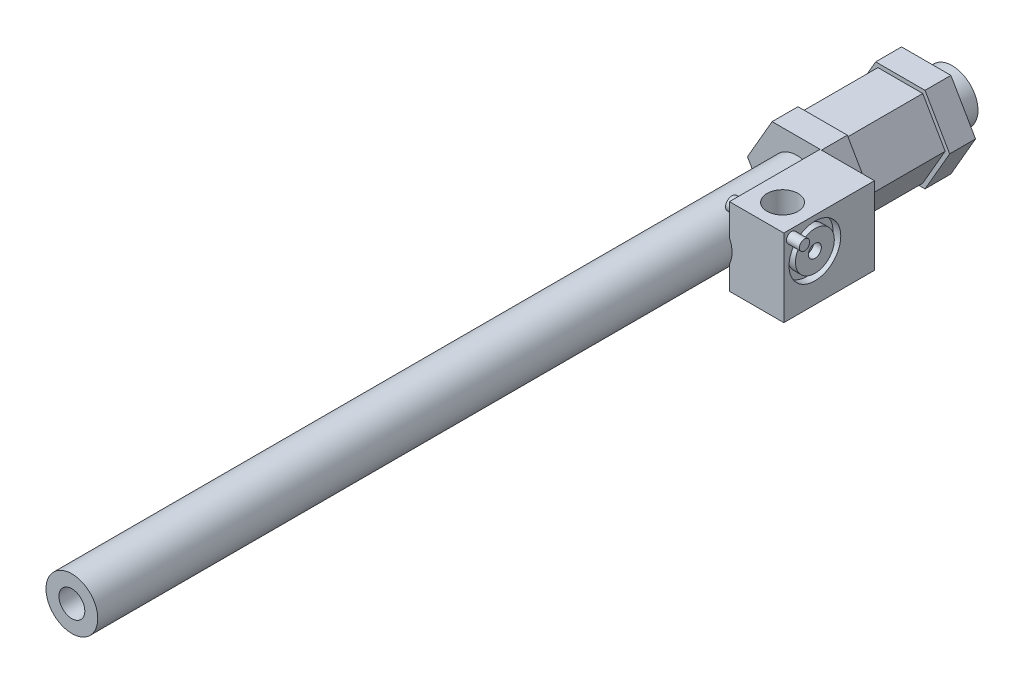
ISO-10303-21;
HEADER;
FILE_DESCRIPTION(('STEP AP214'),'2;1');
FILE_NAME('part.step','',(''),(''),'','','');
FILE_SCHEMA(('AUTOMOTIVE_DESIGN { 1 0 10303 214 1 1 1 1 }'));
ENDSEC;
DATA;
#1=APPLICATION_CONTEXT('core data for automotive mechanical design processes');
#2=APPLICATION_PROTOCOL_DEFINITION('international standard','automotive_design',2000,#1);
#3=PRODUCT_CONTEXT('',#1,'mechanical');
#4=PRODUCT('Part','Part','',(#3));
#5=PRODUCT_RELATED_PRODUCT_CATEGORY('part','',(#4));
#6=PRODUCT_DEFINITION_FORMATION('','',#4);
#7=PRODUCT_DEFINITION_CONTEXT('part definition',#1,'design');
#8=PRODUCT_DEFINITION('design','',#6,#7);
#9=PRODUCT_DEFINITION_SHAPE('','',#8);
#10=(LENGTH_UNIT() NAMED_UNIT(*) SI_UNIT(.MILLI.,.METRE.));
#11=(NAMED_UNIT(*) PLANE_ANGLE_UNIT() SI_UNIT($,.RADIAN.));
#12=(NAMED_UNIT(*) SI_UNIT($,.STERADIAN.) SOLID_ANGLE_UNIT());
#13=UNCERTAINTY_MEASURE_WITH_UNIT(LENGTH_MEASURE(1.E-05),#10,'distance_accuracy_value','');
#14=(GEOMETRIC_REPRESENTATION_CONTEXT(3) GLOBAL_UNCERTAINTY_ASSIGNED_CONTEXT((#13)) GLOBAL_UNIT_ASSIGNED_CONTEXT((#10,
#11,#12)) REPRESENTATION_CONTEXT('',''));
#15=CARTESIAN_POINT('',(0.,0.,0.));
#16=DIRECTION('',(0.,0.,1.));
#17=DIRECTION('',(1.,0.,0.));
#18=AXIS2_PLACEMENT_3D('',#15,#16,#17);
#19=CARTESIAN_POINT('',(0.,0.,60.));
#20=DIRECTION('',(0.,0.,-1.));
#21=DIRECTION('',(-1.,0.,0.));
#22=AXIS2_PLACEMENT_3D('',#19,#20,#21);
#23=PLANE('',#22);
#24=DIRECTION('',(1.,0.,0.));
#25=VECTOR('',#24,1.);
#26=CARTESIAN_POINT('',(9.,-13.5,60.));
#27=LINE('',#26,#25);
#28=CARTESIAN_POINT('',(9.,-13.5,60.));
#29=VERTEX_POINT('',#28);
#30=CARTESIAN_POINT('',(11.2583302491977,-13.5,60.));
#31=VERTEX_POINT('',#30);
#32=EDGE_CURVE('E215',#29,#31,#27,.T.);
#33=ORIENTED_EDGE('',*,*,#32,.F.);
#34=DIRECTION('',(0.,1.,0.));
#35=VECTOR('',#34,1.);
#36=CARTESIAN_POINT('',(9.,0.,60.));
#37=LINE('',#36,#35);
#38=CARTESIAN_POINT('',(9.,-4.35889894354067,60.));
#39=VERTEX_POINT('',#38);
#40=EDGE_CURVE('E416',#29,#39,#37,.T.);
#41=ORIENTED_EDGE('',*,*,#40,.T.);
#42=CARTESIAN_POINT('',(0.,0.,60.));
#43=DIRECTION('',(0.,0.,-1.));
#44=DIRECTION('',(-1.,0.,0.));
#45=AXIS2_PLACEMENT_3D('',#42,#43,#44);
#46=CIRCLE('',#45,10.);
#47=CARTESIAN_POINT('',(9.,4.35889894354067,60.));
#48=VERTEX_POINT('',#47);
#49=EDGE_CURVE('E411',#39,#48,#46,.T.);
#50=ORIENTED_EDGE('',*,*,#49,.T.);
#51=DIRECTION('',(0.,-1.,0.));
#52=VECTOR('',#51,1.);
#53=CARTESIAN_POINT('',(9.,16.5,60.));
#54=LINE('',#53,#52);
#55=CARTESIAN_POINT('',(9.,16.5,60.));
#56=VERTEX_POINT('',#55);
#57=EDGE_CURVE('E242',#56,#48,#54,.T.);
#58=ORIENTED_EDGE('',*,*,#57,.F.);
#59=DIRECTION('',(1.,0.,0.));
#60=VECTOR('',#59,1.);
#61=CARTESIAN_POINT('',(-9.52627944162882,16.5,60.));
#62=LINE('',#61,#60);
#63=CARTESIAN_POINT('',(-9.52627944162882,16.5,60.));
#64=VERTEX_POINT('',#63);
#65=EDGE_CURVE('E287',#64,#56,#62,.T.);
#66=ORIENTED_EDGE('',*,*,#65,.F.);
#67=DIRECTION('',(0.5,0.866025403784438,0.));
#68=VECTOR('',#67,1.);
#69=CARTESIAN_POINT('',(-19.0525588832576,0.,60.));
#70=LINE('',#69,#68);
#71=CARTESIAN_POINT('',(-19.0525588832576,0.,60.));
#72=VERTEX_POINT('',#71);
#73=EDGE_CURVE('E284',#72,#64,#70,.T.);
#74=ORIENTED_EDGE('',*,*,#73,.F.);
#75=DIRECTION('',(-0.5,0.866025403784439,0.));
#76=VECTOR('',#75,1.);
#77=CARTESIAN_POINT('',(-9.52627944162882,-16.5,60.));
#78=LINE('',#77,#76);
#79=CARTESIAN_POINT('',(-9.52627944162882,-16.5,60.));
#80=VERTEX_POINT('',#79);
#81=EDGE_CURVE('E281',#80,#72,#78,.T.);
#82=ORIENTED_EDGE('',*,*,#81,.F.);
#83=DIRECTION('',(-1.,0.,0.));
#84=VECTOR('',#83,1.);
#85=CARTESIAN_POINT('',(9.52627944162882,-16.5,60.));
#86=LINE('',#85,#84);
#87=CARTESIAN_POINT('',(9.52627944162882,-16.5,60.));
#88=VERTEX_POINT('',#87);
#89=EDGE_CURVE('E277',#88,#80,#86,.T.);
#90=ORIENTED_EDGE('',*,*,#89,.F.);
#91=DIRECTION('',(-0.5,-0.866025403784439,0.));
#92=VECTOR('',#91,1.);
#93=CARTESIAN_POINT('',(19.0525588832576,0.,60.));
#94=LINE('',#93,#92);
#95=EDGE_CURVE('E278',#31,#88,#94,.T.);
#96=ORIENTED_EDGE('',*,*,#95,.F.);
#97=EDGE_LOOP('',(#33,#41,#50,#58,#66,#74,#82,#90,#96));
#98=FACE_BOUND('',#97,.T.);
#99=ADVANCED_FACE('F40',(#98),#23,.F.);
#100=CARTESIAN_POINT('',(-8.66025403784439,-15.,60.));
#101=DIRECTION('',(-0.866025403784439,-0.5,0.));
#102=DIRECTION('',(0.5,-0.866025403784439,0.));
#103=AXIS2_PLACEMENT_3D('',#100,#101,#102);
#104=PLANE('',#103);
#105=DIRECTION('',(-0.5,0.866025403784439,0.));
#106=VECTOR('',#105,1.);
#107=CARTESIAN_POINT('',(-8.66025403784439,-15.,50.));
#108=LINE('',#107,#106);
#109=CARTESIAN_POINT('',(-8.66025403784439,-15.,50.));
#110=VERTEX_POINT('',#109);
#111=CARTESIAN_POINT('',(-17.3205080756888,0.,50.));
#112=VERTEX_POINT('',#111);
#113=EDGE_CURVE('E270',#110,#112,#108,.T.);
#114=ORIENTED_EDGE('',*,*,#113,.T.);
#115=DIRECTION('',(0.,0.,-1.));
#116=VECTOR('',#115,1.);
#117=CARTESIAN_POINT('',(-17.3205080756888,0.,60.));
#118=LINE('',#117,#116);
#119=CARTESIAN_POINT('',(-17.3205080756888,0.,20.));
#120=VERTEX_POINT('',#119);
#121=EDGE_CURVE('E389',#112,#120,#118,.T.);
#122=ORIENTED_EDGE('',*,*,#121,.T.);
#123=DIRECTION('',(-0.5,0.866025403784439,0.));
#124=VECTOR('',#123,1.);
#125=CARTESIAN_POINT('',(-8.66025403784439,-15.,20.));
#126=LINE('',#125,#124);
#127=CARTESIAN_POINT('',(-8.66025403784439,-15.,20.));
#128=VERTEX_POINT('',#127);
#129=EDGE_CURVE('E335',#128,#120,#126,.T.);
#130=ORIENTED_EDGE('',*,*,#129,.F.);
#131=DIRECTION('',(0.,0.,-1.));
#132=VECTOR('',#131,1.);
#133=CARTESIAN_POINT('',(-8.66025403784439,-15.,60.));
#134=LINE('',#133,#132);
#135=EDGE_CURVE('E390',#110,#128,#134,.T.);
#136=ORIENTED_EDGE('',*,*,#135,.F.);
#137=EDGE_LOOP('',(#114,#122,#130,#136));
#138=FACE_BOUND('',#137,.T.);
#139=ADVANCED_FACE('F474',(#138),#104,.T.);
#140=CARTESIAN_POINT('',(8.66025403784439,-15.,60.));
#141=DIRECTION('',(0.,-1.,0.));
#142=DIRECTION('',(0.,0.,-1.));
#143=AXIS2_PLACEMENT_3D('',#140,#141,#142);
#144=PLANE('',#143);
#145=DIRECTION('',(-1.,0.,0.));
#146=VECTOR('',#145,1.);
#147=CARTESIAN_POINT('',(8.66025403784439,-15.,50.));
#148=LINE('',#147,#146);
#149=CARTESIAN_POINT('',(8.66025403784439,-15.,50.));
#150=VERTEX_POINT('',#149);
#151=EDGE_CURVE('E63',#150,#110,#148,.T.);
#152=ORIENTED_EDGE('',*,*,#151,.T.);
#153=ORIENTED_EDGE('',*,*,#135,.T.);
#154=DIRECTION('',(-1.,0.,0.));
#155=VECTOR('',#154,1.);
#156=CARTESIAN_POINT('',(8.66025403784439,-15.,20.));
#157=LINE('',#156,#155);
#158=CARTESIAN_POINT('',(8.66025403784439,-15.,20.));
#159=VERTEX_POINT('',#158);
#160=EDGE_CURVE('E332',#159,#128,#157,.T.);
#161=ORIENTED_EDGE('',*,*,#160,.F.);
#162=DIRECTION('',(0.,0.,-1.));
#163=VECTOR('',#162,1.);
#164=CARTESIAN_POINT('',(8.66025403784439,-15.,60.));
#165=LINE('',#164,#163);
#166=EDGE_CURVE('E393',#150,#159,#165,.T.);
#167=ORIENTED_EDGE('',*,*,#166,.F.);
#168=EDGE_LOOP('',(#152,#153,#161,#167));
#169=FACE_BOUND('',#168,.T.);
#170=ADVANCED_FACE('F479',(#169),#144,.T.);
#171=CARTESIAN_POINT('',(17.3205080756888,0.,60.));
#172=DIRECTION('',(0.866025403784439,-0.5,0.));
#173=DIRECTION('',(0.5,0.866025403784439,0.));
#174=AXIS2_PLACEMENT_3D('',#171,#172,#173);
#175=PLANE('',#174);
#176=DIRECTION('',(-0.5,-0.866025403784439,0.));
#177=VECTOR('',#176,1.);
#178=CARTESIAN_POINT('',(17.3205080756888,0.,50.));
#179=LINE('',#178,#177);
#180=CARTESIAN_POINT('',(17.3205080756888,0.,50.));
#181=VERTEX_POINT('',#180);
#182=EDGE_CURVE('E267',#181,#150,#179,.T.);
#183=ORIENTED_EDGE('',*,*,#182,.T.);
#184=ORIENTED_EDGE('',*,*,#166,.T.);
#185=DIRECTION('',(-0.5,-0.866025403784439,0.));
#186=VECTOR('',#185,1.);
#187=CARTESIAN_POINT('',(17.3205080756888,0.,20.));
#188=LINE('',#187,#186);
#189=CARTESIAN_POINT('',(17.3205080756888,0.,20.));
#190=VERTEX_POINT('',#189);
#191=EDGE_CURVE('E329',#190,#159,#188,.T.);
#192=ORIENTED_EDGE('',*,*,#191,.F.);
#193=DIRECTION('',(0.,0.,-1.));
#194=VECTOR('',#193,1.);
#195=CARTESIAN_POINT('',(17.3205080756888,0.,60.));
#196=LINE('',#195,#194);
#197=EDGE_CURVE('E395',#181,#190,#196,.T.);
#198=ORIENTED_EDGE('',*,*,#197,.F.);
#199=EDGE_LOOP('',(#183,#184,#192,#198));
#200=FACE_BOUND('',#199,.T.);
#201=ADVANCED_FACE('F492',(#200),#175,.T.);
#202=CARTESIAN_POINT('',(8.6602540378444,15.,60.));
#203=DIRECTION('',(0.866025403784439,0.5,0.));
#204=DIRECTION('',(-0.5,0.866025403784439,0.));
#205=AXIS2_PLACEMENT_3D('',#202,#203,#204);
#206=PLANE('',#205);
#207=DIRECTION('',(0.5,-0.866025403784439,0.));
#208=VECTOR('',#207,1.);
#209=CARTESIAN_POINT('',(8.6602540378444,15.,50.));
#210=LINE('',#209,#208);
#211=CARTESIAN_POINT('',(8.6602540378444,15.,50.));
#212=VERTEX_POINT('',#211);
#213=EDGE_CURVE('E265',#212,#181,#210,.T.);
#214=ORIENTED_EDGE('',*,*,#213,.T.);
#215=ORIENTED_EDGE('',*,*,#197,.T.);
#216=DIRECTION('',(0.5,-0.866025403784439,0.));
#217=VECTOR('',#216,1.);
#218=CARTESIAN_POINT('',(8.6602540378444,15.,20.));
#219=LINE('',#218,#217);
#220=CARTESIAN_POINT('',(8.6602540378444,15.,20.));
#221=VERTEX_POINT('',#220);
#222=EDGE_CURVE('E326',#221,#190,#219,.T.);
#223=ORIENTED_EDGE('',*,*,#222,.F.);
#224=DIRECTION('',(0.,0.,-1.));
#225=VECTOR('',#224,1.);
#226=CARTESIAN_POINT('',(8.6602540378444,15.,60.));
#227=LINE('',#226,#225);
#228=EDGE_CURVE('E397',#212,#221,#227,.T.);
#229=ORIENTED_EDGE('',*,*,#228,.F.);
#230=EDGE_LOOP('',(#214,#215,#223,#229));
#231=FACE_BOUND('',#230,.T.);
#232=ADVANCED_FACE('F495',(#231),#206,.T.);
#233=CARTESIAN_POINT('',(-8.66025403784437,15.,60.));
#234=DIRECTION('',(0.,1.,0.));
#235=DIRECTION('',(-1.,0.,0.));
#236=AXIS2_PLACEMENT_3D('',#233,#234,#235);
#237=PLANE('',#236);
#238=DIRECTION('',(1.,0.,0.));
#239=VECTOR('',#238,1.);
#240=CARTESIAN_POINT('',(-8.66025403784437,15.,50.));
#241=LINE('',#240,#239);
#242=CARTESIAN_POINT('',(-8.66025403784437,15.,50.));
#243=VERTEX_POINT('',#242);
#244=EDGE_CURVE('E263',#243,#212,#241,.T.);
#245=ORIENTED_EDGE('',*,*,#244,.T.);
#246=ORIENTED_EDGE('',*,*,#228,.T.);
#247=DIRECTION('',(1.,0.,0.));
#248=VECTOR('',#247,1.);
#249=CARTESIAN_POINT('',(-8.66025403784437,15.,20.));
#250=LINE('',#249,#248);
#251=CARTESIAN_POINT('',(-8.66025403784437,15.,20.));
#252=VERTEX_POINT('',#251);
#253=EDGE_CURVE('E323',#252,#221,#250,.T.);
#254=ORIENTED_EDGE('',*,*,#253,.F.);
#255=DIRECTION('',(0.,0.,-1.));
#256=VECTOR('',#255,1.);
#257=CARTESIAN_POINT('',(-8.66025403784437,15.,60.));
#258=LINE('',#257,#256);
#259=EDGE_CURVE('E399',#243,#252,#258,.T.);
#260=ORIENTED_EDGE('',*,*,#259,.F.);
#261=EDGE_LOOP('',(#245,#246,#254,#260));
#262=FACE_BOUND('',#261,.T.);
#263=ADVANCED_FACE('F499',(#262),#237,.T.);
#264=CARTESIAN_POINT('',(-17.3205080756888,0.,60.));
#265=DIRECTION('',(-0.866025403784439,0.5,0.));
#266=DIRECTION('',(-0.5,-0.866025403784439,0.));
#267=AXIS2_PLACEMENT_3D('',#264,#265,#266);
#268=PLANE('',#267);
#269=DIRECTION('',(0.5,0.866025403784439,0.));
#270=VECTOR('',#269,1.);
#271=CARTESIAN_POINT('',(-17.3205080756888,0.,50.));
#272=LINE('',#271,#270);
#273=EDGE_CURVE('E261',#112,#243,#272,.T.);
#274=ORIENTED_EDGE('',*,*,#273,.T.);
#275=ORIENTED_EDGE('',*,*,#259,.T.);
#276=DIRECTION('',(0.5,0.866025403784439,0.));
#277=VECTOR('',#276,1.);
#278=CARTESIAN_POINT('',(-17.3205080756888,0.,20.));
#279=LINE('',#278,#277);
#280=EDGE_CURVE('E311',#120,#252,#279,.T.);
#281=ORIENTED_EDGE('',*,*,#280,.F.);
#282=ORIENTED_EDGE('',*,*,#121,.F.);
#283=EDGE_LOOP('',(#274,#275,#281,#282));
#284=FACE_BOUND('',#283,.T.);
#285=ADVANCED_FACE('F503',(#284),#268,.T.);
#286=CARTESIAN_POINT('',(19.0525588832576,0.,20.));
#287=DIRECTION('',(0.866025403784439,-0.5,0.));
#288=DIRECTION('',(0.5,0.866025403784439,0.));
#289=AXIS2_PLACEMENT_3D('',#286,#287,#288);
#290=PLANE('',#289);
#291=DIRECTION('',(-0.5,-0.866025403784439,0.));
#292=VECTOR('',#291,1.);
#293=CARTESIAN_POINT('',(19.0525588832576,0.,10.));
#294=LINE('',#293,#292);
#295=CARTESIAN_POINT('',(19.0525588832576,0.,10.));
#296=VERTEX_POINT('',#295);
#297=CARTESIAN_POINT('',(9.52627944162882,-16.5,10.));
#298=VERTEX_POINT('',#297);
#299=EDGE_CURVE('E338',#296,#298,#294,.T.);
#300=ORIENTED_EDGE('',*,*,#299,.F.);
#301=DIRECTION('',(0.,0.,-1.));
#302=VECTOR('',#301,1.);
#303=CARTESIAN_POINT('',(19.0525588832576,0.,20.));
#304=LINE('',#303,#302);
#305=CARTESIAN_POINT('',(19.0525588832576,0.,20.));
#306=VERTEX_POINT('',#305);
#307=EDGE_CURVE('E375',#306,#296,#304,.T.);
#308=ORIENTED_EDGE('',*,*,#307,.F.);
#309=DIRECTION('',(-0.5,-0.866025403784439,0.));
#310=VECTOR('',#309,1.);
#311=CARTESIAN_POINT('',(19.0525588832576,0.,20.));
#312=LINE('',#311,#310);
#313=CARTESIAN_POINT('',(9.52627944162882,-16.5,20.));
#314=VERTEX_POINT('',#313);
#315=EDGE_CURVE('E339',#306,#314,#312,.T.);
#316=ORIENTED_EDGE('',*,*,#315,.T.);
#317=DIRECTION('',(0.,0.,-1.));
#318=VECTOR('',#317,1.);
#319=CARTESIAN_POINT('',(9.52627944162882,-16.5,20.));
#320=LINE('',#319,#318);
#321=EDGE_CURVE('E358',#314,#298,#320,.T.);
#322=ORIENTED_EDGE('',*,*,#321,.T.);
#323=EDGE_LOOP('',(#300,#308,#316,#322));
#324=FACE_BOUND('',#323,.T.);
#325=ADVANCED_FACE('F484',(#324),#290,.T.);
#326=CARTESIAN_POINT('',(9.52627944162883,16.5,20.));
#327=DIRECTION('',(0.866025403784439,0.499999999999999,0.));
#328=DIRECTION('',(-0.5,0.866025403784439,0.));
#329=AXIS2_PLACEMENT_3D('',#326,#327,#328);
#330=PLANE('',#329);
#331=DIRECTION('',(0.499999999999999,-0.866025403784439,0.));
#332=VECTOR('',#331,1.);
#333=CARTESIAN_POINT('',(9.52627944162883,16.5,10.));
#334=LINE('',#333,#332);
#335=CARTESIAN_POINT('',(9.52627944162883,16.5,10.));
#336=VERTEX_POINT('',#335);
#337=EDGE_CURVE('E343',#336,#296,#334,.T.);
#338=ORIENTED_EDGE('',*,*,#337,.F.);
#339=DIRECTION('',(0.,0.,-1.));
#340=VECTOR('',#339,1.);
#341=CARTESIAN_POINT('',(9.52627944162883,16.5,20.));
#342=LINE('',#341,#340);
#343=CARTESIAN_POINT('',(9.52627944162883,16.5,20.));
#344=VERTEX_POINT('',#343);
#345=EDGE_CURVE('E378',#344,#336,#342,.T.);
#346=ORIENTED_EDGE('',*,*,#345,.F.);
#347=DIRECTION('',(0.499999999999999,-0.866025403784439,0.));
#348=VECTOR('',#347,1.);
#349=CARTESIAN_POINT('',(9.52627944162883,16.5,20.));
#350=LINE('',#349,#348);
#351=EDGE_CURVE('E355',#344,#306,#350,.T.);
#352=ORIENTED_EDGE('',*,*,#351,.T.);
#353=ORIENTED_EDGE('',*,*,#307,.T.);
#354=EDGE_LOOP('',(#338,#346,#352,#353));
#355=FACE_BOUND('',#354,.T.);
#356=ADVANCED_FACE('F536',(#355),#330,.T.);
#357=CARTESIAN_POINT('',(-9.52627944162882,16.5,20.));
#358=DIRECTION('',(0.,1.,0.));
#359=DIRECTION('',(-1.,0.,0.));
#360=AXIS2_PLACEMENT_3D('',#357,#358,#359);
#361=PLANE('',#360);
#362=DIRECTION('',(1.,0.,0.));
#363=VECTOR('',#362,1.);
#364=CARTESIAN_POINT('',(-9.52627944162882,16.5,10.));
#365=LINE('',#364,#363);
#366=CARTESIAN_POINT('',(-9.52627944162882,16.5,10.));
#367=VERTEX_POINT('',#366);
#368=EDGE_CURVE('E370',#367,#336,#365,.T.);
#369=ORIENTED_EDGE('',*,*,#368,.F.);
#370=DIRECTION('',(0.,0.,-1.));
#371=VECTOR('',#370,1.);
#372=CARTESIAN_POINT('',(-9.52627944162882,16.5,20.));
#373=LINE('',#372,#371);
#374=CARTESIAN_POINT('',(-9.52627944162882,16.5,20.));
#375=VERTEX_POINT('',#374);
#376=EDGE_CURVE('E380',#375,#367,#373,.T.);
#377=ORIENTED_EDGE('',*,*,#376,.F.);
#378=DIRECTION('',(1.,0.,0.));
#379=VECTOR('',#378,1.);
#380=CARTESIAN_POINT('',(-9.52627944162882,16.5,20.));
#381=LINE('',#380,#379);
#382=EDGE_CURVE('E352',#375,#344,#381,.T.);
#383=ORIENTED_EDGE('',*,*,#382,.T.);
#384=ORIENTED_EDGE('',*,*,#345,.T.);
#385=EDGE_LOOP('',(#369,#377,#383,#384));
#386=FACE_BOUND('',#385,.T.);
#387=ADVANCED_FACE('F539',(#386),#361,.T.);
#388=CARTESIAN_POINT('',(-19.0525588832576,0.,20.));
#389=DIRECTION('',(-0.866025403784439,0.5,0.));
#390=DIRECTION('',(-0.5,-0.866025403784439,0.));
#391=AXIS2_PLACEMENT_3D('',#388,#389,#390);
#392=PLANE('',#391);
#393=DIRECTION('',(0.5,0.866025403784438,0.));
#394=VECTOR('',#393,1.);
#395=CARTESIAN_POINT('',(-19.0525588832576,0.,10.));
#396=LINE('',#395,#394);
#397=CARTESIAN_POINT('',(-19.0525588832576,0.,10.));
#398=VERTEX_POINT('',#397);
#399=EDGE_CURVE('E367',#398,#367,#396,.T.);
#400=ORIENTED_EDGE('',*,*,#399,.F.);
#401=DIRECTION('',(0.,0.,-1.));
#402=VECTOR('',#401,1.);
#403=CARTESIAN_POINT('',(-19.0525588832576,0.,20.));
#404=LINE('',#403,#402);
#405=CARTESIAN_POINT('',(-19.0525588832576,0.,20.));
#406=VERTEX_POINT('',#405);
#407=EDGE_CURVE('E382',#406,#398,#404,.T.);
#408=ORIENTED_EDGE('',*,*,#407,.F.);
#409=DIRECTION('',(0.5,0.866025403784438,0.));
#410=VECTOR('',#409,1.);
#411=CARTESIAN_POINT('',(-19.0525588832576,0.,20.));
#412=LINE('',#411,#410);
#413=EDGE_CURVE('E349',#406,#375,#412,.T.);
#414=ORIENTED_EDGE('',*,*,#413,.T.);
#415=ORIENTED_EDGE('',*,*,#376,.T.);
#416=EDGE_LOOP('',(#400,#408,#414,#415));
#417=FACE_BOUND('',#416,.T.);
#418=ADVANCED_FACE('F543',(#417),#392,.T.);
#419=CARTESIAN_POINT('',(-9.52627944162882,-16.5,20.));
#420=DIRECTION('',(-0.866025403784439,-0.5,0.));
#421=DIRECTION('',(0.5,-0.866025403784439,0.));
#422=AXIS2_PLACEMENT_3D('',#419,#420,#421);
#423=PLANE('',#422);
#424=DIRECTION('',(-0.5,0.866025403784439,0.));
#425=VECTOR('',#424,1.);
#426=CARTESIAN_POINT('',(-9.52627944162882,-16.5,10.));
#427=LINE('',#426,#425);
#428=CARTESIAN_POINT('',(-9.52627944162882,-16.5,10.));
#429=VERTEX_POINT('',#428);
#430=EDGE_CURVE('E364',#429,#398,#427,.T.);
#431=ORIENTED_EDGE('',*,*,#430,.F.);
#432=DIRECTION('',(0.,0.,-1.));
#433=VECTOR('',#432,1.);
#434=CARTESIAN_POINT('',(-9.52627944162882,-16.5,20.));
#435=LINE('',#434,#433);
#436=CARTESIAN_POINT('',(-9.52627944162882,-16.5,20.));
#437=VERTEX_POINT('',#436);
#438=EDGE_CURVE('E384',#437,#429,#435,.T.);
#439=ORIENTED_EDGE('',*,*,#438,.F.);
#440=DIRECTION('',(-0.5,0.866025403784439,0.));
#441=VECTOR('',#440,1.);
#442=CARTESIAN_POINT('',(-9.52627944162882,-16.5,20.));
#443=LINE('',#442,#441);
#444=EDGE_CURVE('E346',#437,#406,#443,.T.);
#445=ORIENTED_EDGE('',*,*,#444,.T.);
#446=ORIENTED_EDGE('',*,*,#407,.T.);
#447=EDGE_LOOP('',(#431,#439,#445,#446));
#448=FACE_BOUND('',#447,.T.);
#449=ADVANCED_FACE('F531',(#448),#423,.T.);
#450=CARTESIAN_POINT('',(9.52627944162882,-16.5,20.));
#451=DIRECTION('',(0.,-1.,0.));
#452=DIRECTION('',(0.,0.,-1.));
#453=AXIS2_PLACEMENT_3D('',#450,#451,#452);
#454=PLANE('',#453);
#455=DIRECTION('',(-1.,0.,0.));
#456=VECTOR('',#455,1.);
#457=CARTESIAN_POINT('',(9.52627944162882,-16.5,10.));
#458=LINE('',#457,#456);
#459=EDGE_CURVE('E361',#298,#429,#458,.T.);
#460=ORIENTED_EDGE('',*,*,#459,.F.);
#461=ORIENTED_EDGE('',*,*,#321,.F.);
#462=DIRECTION('',(-1.,0.,0.));
#463=VECTOR('',#462,1.);
#464=CARTESIAN_POINT('',(9.52627944162882,-16.5,20.));
#465=LINE('',#464,#463);
#466=EDGE_CURVE('E342',#314,#437,#465,.T.);
#467=ORIENTED_EDGE('',*,*,#466,.T.);
#468=ORIENTED_EDGE('',*,*,#438,.T.);
#469=EDGE_LOOP('',(#460,#461,#467,#468));
#470=FACE_BOUND('',#469,.T.);
#471=ADVANCED_FACE('F523',(#470),#454,.T.);
#472=CARTESIAN_POINT('',(0.,0.,20.));
#473=DIRECTION('',(0.,0.,-1.));
#474=DIRECTION('',(-1.,0.,0.));
#475=AXIS2_PLACEMENT_3D('',#472,#473,#474);
#476=PLANE('',#475);
#477=ORIENTED_EDGE('',*,*,#129,.T.);
#478=ORIENTED_EDGE('',*,*,#280,.T.);
#479=ORIENTED_EDGE('',*,*,#253,.T.);
#480=ORIENTED_EDGE('',*,*,#222,.T.);
#481=ORIENTED_EDGE('',*,*,#191,.T.);
#482=ORIENTED_EDGE('',*,*,#160,.T.);
#483=EDGE_LOOP('',(#477,#478,#479,#480,#481,#482));
#484=FACE_BOUND('',#483,.T.);
#485=ORIENTED_EDGE('',*,*,#315,.F.);
#486=ORIENTED_EDGE('',*,*,#351,.F.);
#487=ORIENTED_EDGE('',*,*,#382,.F.);
#488=ORIENTED_EDGE('',*,*,#413,.F.);
#489=ORIENTED_EDGE('',*,*,#444,.F.);
#490=ORIENTED_EDGE('',*,*,#466,.F.);
#491=EDGE_LOOP('',(#485,#486,#487,#488,#489,#490));
#492=FACE_BOUND('',#491,.T.);
#493=ADVANCED_FACE('F516',(#484,#492),#476,.F.);
#494=CARTESIAN_POINT('',(0.,0.,0.));
#495=DIRECTION('',(0.,0.,1.));
#496=DIRECTION('',(1.,0.,0.));
#497=AXIS2_PLACEMENT_3D('',#494,#495,#496);
#498=PLANE('',#497);
#499=CARTESIAN_POINT('',(0.,0.,0.));
#500=DIRECTION('',(0.,0.,1.));
#501=DIRECTION('',(1.,0.,0.));
#502=AXIS2_PLACEMENT_3D('',#499,#500,#501);
#503=CIRCLE('',#502,10.);
#504=CARTESIAN_POINT('',(10.,0.,0.));
#505=VERTEX_POINT('',#504);
#506=EDGE_CURVE('E405',#505,#505,#503,.T.);
#507=ORIENTED_EDGE('',*,*,#506,.F.);
#508=EDGE_LOOP('',(#507));
#509=FACE_BOUND('',#508,.T.);
#510=ADVANCED_FACE('F514',(#509),#498,.F.);
#511=CARTESIAN_POINT('',(0.,0.,340.));
#512=DIRECTION('',(0.,0.,-1.));
#513=DIRECTION('',(-1.,0.,0.));
#514=AXIS2_PLACEMENT_3D('',#511,#512,#513);
#515=CYLINDRICAL_SURFACE('',#514,10.);
#516=CARTESIAN_POINT('',(0.,0.,10.));
#517=DIRECTION('',(0.,0.,-1.));
#518=DIRECTION('',(-1.,0.,0.));
#519=AXIS2_PLACEMENT_3D('',#516,#517,#518);
#520=CIRCLE('',#519,10.);
#521=CARTESIAN_POINT('',(-10.,0.,10.));
#522=VERTEX_POINT('',#521);
#523=EDGE_CURVE('E377',#522,#522,#520,.T.);
#524=ORIENTED_EDGE('',*,*,#523,.T.);
#525=EDGE_LOOP('',(#524));
#526=FACE_BOUND('',#525,.T.);
#527=ORIENTED_EDGE('',*,*,#506,.T.);
#528=EDGE_LOOP('',(#527));
#529=FACE_BOUND('',#528,.T.);
#530=ADVANCED_FACE('F42',(#526,#529),#515,.T.);
#531=CARTESIAN_POINT('',(0.,0.,10.));
#532=DIRECTION('',(0.,0.,-1.));
#533=DIRECTION('',(-1.,0.,0.));
#534=AXIS2_PLACEMENT_3D('',#531,#532,#533);
#535=PLANE('',#534);
#536=ORIENTED_EDGE('',*,*,#523,.F.);
#537=EDGE_LOOP('',(#536));
#538=FACE_BOUND('',#537,.T.);
#539=ORIENTED_EDGE('',*,*,#299,.T.);
#540=ORIENTED_EDGE('',*,*,#459,.T.);
#541=ORIENTED_EDGE('',*,*,#430,.T.);
#542=ORIENTED_EDGE('',*,*,#399,.T.);
#543=ORIENTED_EDGE('',*,*,#368,.T.);
#544=ORIENTED_EDGE('',*,*,#337,.T.);
#545=EDGE_LOOP('',(#539,#540,#541,#542,#543,#544));
#546=FACE_BOUND('',#545,.T.);
#547=ADVANCED_FACE('F486',(#538,#546),#535,.T.);
#548=CARTESIAN_POINT('',(19.0525588832576,0.,60.));
#549=DIRECTION('',(0.866025403784439,-0.5,0.));
#550=DIRECTION('',(0.5,0.866025403784439,0.));
#551=AXIS2_PLACEMENT_3D('',#548,#549,#550);
#552=PLANE('',#551);
#553=DIRECTION('',(-0.5,-0.866025403784439,0.));
#554=VECTOR('',#553,1.);
#555=CARTESIAN_POINT('',(19.0525588832576,0.,50.));
#556=LINE('',#555,#554);
#557=CARTESIAN_POINT('',(19.0525588832576,0.,50.));
#558=VERTEX_POINT('',#557);
#559=CARTESIAN_POINT('',(9.52627944162882,-16.5,50.));
#560=VERTEX_POINT('',#559);
#561=EDGE_CURVE('E273',#558,#560,#556,.T.);
#562=ORIENTED_EDGE('',*,*,#561,.F.);
#563=DIRECTION('',(0.,0.,-1.));
#564=VECTOR('',#563,1.);
#565=CARTESIAN_POINT('',(19.0525588832576,0.,60.));
#566=LINE('',#565,#564);
#567=CARTESIAN_POINT('',(19.0525588832576,0.,60.));
#568=VERTEX_POINT('',#567);
#569=EDGE_CURVE('E309',#568,#558,#566,.T.);
#570=ORIENTED_EDGE('',*,*,#569,.F.);
#571=EDGE_CURVE('E274',#568,#31,#94,.T.);
#572=ORIENTED_EDGE('',*,*,#571,.T.);
#573=ORIENTED_EDGE('',*,*,#95,.T.);
#574=DIRECTION('',(0.,0.,-1.));
#575=VECTOR('',#574,1.);
#576=CARTESIAN_POINT('',(9.52627944162882,-16.5,60.));
#577=LINE('',#576,#575);
#578=EDGE_CURVE('E291',#88,#560,#577,.T.);
#579=ORIENTED_EDGE('',*,*,#578,.T.);
#580=EDGE_LOOP('',(#562,#570,#572,#573,#579));
#581=FACE_BOUND('',#580,.T.);
#582=ADVANCED_FACE('F451',(#581),#552,.T.);
#583=CARTESIAN_POINT('',(9.52627944162883,16.5,60.));
#584=DIRECTION('',(0.866025403784439,0.499999999999999,0.));
#585=DIRECTION('',(-0.5,0.866025403784439,0.));
#586=AXIS2_PLACEMENT_3D('',#583,#584,#585);
#587=PLANE('',#586);
#588=DIRECTION('',(0.499999999999999,-0.866025403784439,0.));
#589=VECTOR('',#588,1.);
#590=CARTESIAN_POINT('',(9.52627944162883,16.5,50.));
#591=LINE('',#590,#589);
#592=CARTESIAN_POINT('',(9.52627944162883,16.5,50.));
#593=VERTEX_POINT('',#592);
#594=EDGE_CURVE('E306',#593,#558,#591,.T.);
#595=ORIENTED_EDGE('',*,*,#594,.F.);
#596=DIRECTION('',(0.,0.,-1.));
#597=VECTOR('',#596,1.);
#598=CARTESIAN_POINT('',(9.52627944162883,16.5,60.));
#599=LINE('',#598,#597);
#600=CARTESIAN_POINT('',(9.52627944162883,16.5,60.));
#601=VERTEX_POINT('',#600);
#602=EDGE_CURVE('E312',#601,#593,#599,.T.);
#603=ORIENTED_EDGE('',*,*,#602,.F.);
#604=DIRECTION('',(0.499999999999999,-0.866025403784439,0.));
#605=VECTOR('',#604,1.);
#606=CARTESIAN_POINT('',(9.52627944162883,16.5,60.));
#607=LINE('',#606,#605);
#608=EDGE_CURVE('E211',#601,#568,#607,.T.);
#609=ORIENTED_EDGE('',*,*,#608,.T.);
#610=ORIENTED_EDGE('',*,*,#569,.T.);
#611=EDGE_LOOP('',(#595,#603,#609,#610));
#612=FACE_BOUND('',#611,.T.);
#613=ADVANCED_FACE('F455',(#612),#587,.T.);
#614=CARTESIAN_POINT('',(-9.52627944162882,16.5,60.));
#615=DIRECTION('',(0.,1.,0.));
#616=DIRECTION('',(-1.,0.,0.));
#617=AXIS2_PLACEMENT_3D('',#614,#615,#616);
#618=PLANE('',#617);
#619=CARTESIAN_POINT('',(19.5,16.5,85.));
#620=DIRECTION('',(0.,1.,0.));
#621=DIRECTION('',(0.,0.,1.));
#622=AXIS2_PLACEMENT_3D('',#619,#620,#621);
#623=CIRCLE('',#622,6.);
#624=CARTESIAN_POINT('',(19.5,16.5,91.));
#625=VERTEX_POINT('',#624);
#626=EDGE_CURVE('E235',#625,#625,#623,.T.);
#627=ORIENTED_EDGE('',*,*,#626,.F.);
#628=EDGE_LOOP('',(#627));
#629=FACE_BOUND('',#628,.T.);
#630=DIRECTION('',(1.,0.,0.));
#631=VECTOR('',#630,1.);
#632=CARTESIAN_POINT('',(-9.52627944162882,16.5,50.));
#633=LINE('',#632,#631);
#634=CARTESIAN_POINT('',(-9.52627944162882,16.5,50.));
#635=VERTEX_POINT('',#634);
#636=EDGE_CURVE('E303',#635,#593,#633,.T.);
#637=ORIENTED_EDGE('',*,*,#636,.F.);
#638=DIRECTION('',(0.,0.,-1.));
#639=VECTOR('',#638,1.);
#640=CARTESIAN_POINT('',(-9.52627944162882,16.5,60.));
#641=LINE('',#640,#639);
#642=EDGE_CURVE('E314',#64,#635,#641,.T.);
#643=ORIENTED_EDGE('',*,*,#642,.F.);
#644=ORIENTED_EDGE('',*,*,#65,.T.);
#645=DIRECTION('',(0.,0.,-1.));
#646=VECTOR('',#645,1.);
#647=CARTESIAN_POINT('',(9.,16.5,95.));
#648=LINE('',#647,#646);
#649=CARTESIAN_POINT('',(9.,16.5,95.));
#650=VERTEX_POINT('',#649);
#651=EDGE_CURVE('E55',#650,#56,#648,.T.);
#652=ORIENTED_EDGE('',*,*,#651,.F.);
#653=DIRECTION('',(1.,0.,0.));
#654=VECTOR('',#653,1.);
#655=CARTESIAN_POINT('',(9.,16.5,95.));
#656=LINE('',#655,#654);
#657=CARTESIAN_POINT('',(30.,16.5,95.));
#658=VERTEX_POINT('',#657);
#659=EDGE_CURVE('E222',#650,#658,#656,.T.);
#660=ORIENTED_EDGE('',*,*,#659,.T.);
#661=DIRECTION('',(0.,0.,1.));
#662=VECTOR('',#661,1.);
#663=CARTESIAN_POINT('',(30.,16.5,60.));
#664=LINE('',#663,#662);
#665=CARTESIAN_POINT('',(30.,16.5,60.));
#666=VERTEX_POINT('',#665);
#667=EDGE_CURVE('E218',#666,#658,#664,.T.);
#668=ORIENTED_EDGE('',*,*,#667,.F.);
#669=DIRECTION('',(1.,0.,0.));
#670=VECTOR('',#669,1.);
#671=CARTESIAN_POINT('',(9.,16.5,60.));
#672=LINE('',#671,#670);
#673=EDGE_CURVE('E205',#601,#666,#672,.T.);
#674=ORIENTED_EDGE('',*,*,#673,.F.);
#675=ORIENTED_EDGE('',*,*,#602,.T.);
#676=EDGE_LOOP('',(#637,#643,#644,#652,#660,#668,#674,#675));
#677=FACE_BOUND('',#676,.T.);
#678=ADVANCED_FACE('F220',(#629,#677),#618,.T.);
#679=CARTESIAN_POINT('',(-19.0525588832576,0.,60.));
#680=DIRECTION('',(-0.866025403784439,0.5,0.));
#681=DIRECTION('',(-0.5,-0.866025403784439,0.));
#682=AXIS2_PLACEMENT_3D('',#679,#680,#681);
#683=PLANE('',#682);
#684=DIRECTION('',(0.5,0.866025403784438,0.));
#685=VECTOR('',#684,1.);
#686=CARTESIAN_POINT('',(-19.0525588832576,0.,50.));
#687=LINE('',#686,#685);
#688=CARTESIAN_POINT('',(-19.0525588832576,0.,50.));
#689=VERTEX_POINT('',#688);
#690=EDGE_CURVE('E300',#689,#635,#687,.T.);
#691=ORIENTED_EDGE('',*,*,#690,.F.);
#692=DIRECTION('',(0.,0.,-1.));
#693=VECTOR('',#692,1.);
#694=CARTESIAN_POINT('',(-19.0525588832576,0.,60.));
#695=LINE('',#694,#693);
#696=EDGE_CURVE('E316',#72,#689,#695,.T.);
#697=ORIENTED_EDGE('',*,*,#696,.F.);
#698=ORIENTED_EDGE('',*,*,#73,.T.);
#699=ORIENTED_EDGE('',*,*,#642,.T.);
#700=EDGE_LOOP('',(#691,#697,#698,#699));
#701=FACE_BOUND('',#700,.T.);
#702=ADVANCED_FACE('F440',(#701),#683,.T.);
#703=CARTESIAN_POINT('',(-9.52627944162882,-16.5,60.));
#704=DIRECTION('',(-0.866025403784439,-0.5,0.));
#705=DIRECTION('',(0.5,-0.866025403784439,0.));
#706=AXIS2_PLACEMENT_3D('',#703,#704,#705);
#707=PLANE('',#706);
#708=DIRECTION('',(-0.5,0.866025403784439,0.));
#709=VECTOR('',#708,1.);
#710=CARTESIAN_POINT('',(-9.52627944162882,-16.5,50.));
#711=LINE('',#710,#709);
#712=CARTESIAN_POINT('',(-9.52627944162882,-16.5,50.));
#713=VERTEX_POINT('',#712);
#714=EDGE_CURVE('E297',#713,#689,#711,.T.);
#715=ORIENTED_EDGE('',*,*,#714,.F.);
#716=DIRECTION('',(0.,0.,-1.));
#717=VECTOR('',#716,1.);
#718=CARTESIAN_POINT('',(-9.52627944162882,-16.5,60.));
#719=LINE('',#718,#717);
#720=EDGE_CURVE('E318',#80,#713,#719,.T.);
#721=ORIENTED_EDGE('',*,*,#720,.F.);
#722=ORIENTED_EDGE('',*,*,#81,.T.);
#723=ORIENTED_EDGE('',*,*,#696,.T.);
#724=EDGE_LOOP('',(#715,#721,#722,#723));
#725=FACE_BOUND('',#724,.T.);
#726=ADVANCED_FACE('F443',(#725),#707,.T.);
#727=CARTESIAN_POINT('',(9.52627944162882,-16.5,60.));
#728=DIRECTION('',(0.,-1.,0.));
#729=DIRECTION('',(0.,0.,-1.));
#730=AXIS2_PLACEMENT_3D('',#727,#728,#729);
#731=PLANE('',#730);
#732=DIRECTION('',(-1.,0.,0.));
#733=VECTOR('',#732,1.);
#734=CARTESIAN_POINT('',(9.52627944162882,-16.5,50.));
#735=LINE('',#734,#733);
#736=EDGE_CURVE('E294',#560,#713,#735,.T.);
#737=ORIENTED_EDGE('',*,*,#736,.F.);
#738=ORIENTED_EDGE('',*,*,#578,.F.);
#739=ORIENTED_EDGE('',*,*,#89,.T.);
#740=ORIENTED_EDGE('',*,*,#720,.T.);
#741=EDGE_LOOP('',(#737,#738,#739,#740));
#742=FACE_BOUND('',#741,.T.);
#743=ADVANCED_FACE('F448',(#742),#731,.T.);
#744=CARTESIAN_POINT('',(0.,0.,50.));
#745=DIRECTION('',(0.,0.,-1.));
#746=DIRECTION('',(-1.,0.,0.));
#747=AXIS2_PLACEMENT_3D('',#744,#745,#746);
#748=PLANE('',#747);
#749=ORIENTED_EDGE('',*,*,#273,.F.);
#750=ORIENTED_EDGE('',*,*,#113,.F.);
#751=ORIENTED_EDGE('',*,*,#151,.F.);
#752=ORIENTED_EDGE('',*,*,#182,.F.);
#753=ORIENTED_EDGE('',*,*,#213,.F.);
#754=ORIENTED_EDGE('',*,*,#244,.F.);
#755=EDGE_LOOP('',(#749,#750,#751,#752,#753,#754));
#756=FACE_BOUND('',#755,.T.);
#757=ORIENTED_EDGE('',*,*,#561,.T.);
#758=ORIENTED_EDGE('',*,*,#736,.T.);
#759=ORIENTED_EDGE('',*,*,#714,.T.);
#760=ORIENTED_EDGE('',*,*,#690,.T.);
#761=ORIENTED_EDGE('',*,*,#636,.T.);
#762=ORIENTED_EDGE('',*,*,#594,.T.);
#763=EDGE_LOOP('',(#757,#758,#759,#760,#761,#762));
#764=FACE_BOUND('',#763,.T.);
#765=ADVANCED_FACE('F457',(#756,#764),#748,.T.);
#766=CARTESIAN_POINT('',(0.,0.,10.));
#767=DIRECTION('',(0.,0.,1.));
#768=DIRECTION('',(1.,0.,0.));
#769=AXIS2_PLACEMENT_3D('',#766,#767,#768);
#770=PLANE('',#769);
#771=CARTESIAN_POINT('',(0.,0.,10.));
#772=DIRECTION('',(0.,0.,1.));
#773=DIRECTION('',(1.,0.,0.));
#774=AXIS2_PLACEMENT_3D('',#771,#772,#773);
#775=CIRCLE('',#774,5.);
#776=CARTESIAN_POINT('',(5.,0.,10.));
#777=VERTEX_POINT('',#776);
#778=EDGE_CURVE('E402',#777,#777,#775,.T.);
#779=ORIENTED_EDGE('',*,*,#778,.T.);
#780=EDGE_LOOP('',(#779));
#781=FACE_BOUND('',#780,.T.);
#782=ADVANCED_FACE('F459',(#781),#770,.T.);
#783=CARTESIAN_POINT('',(0.,0.,10.));
#784=DIRECTION('',(0.,0.,1.));
#785=DIRECTION('',(1.,0.,0.));
#786=AXIS2_PLACEMENT_3D('',#783,#784,#785);
#787=CYLINDRICAL_SURFACE('',#786,5.);
#788=ORIENTED_EDGE('',*,*,#778,.F.);
#789=EDGE_LOOP('',(#788));
#790=FACE_BOUND('',#789,.T.);
#791=CARTESIAN_POINT('',(0.,0.,340.));
#792=DIRECTION('',(0.,0.,1.));
#793=DIRECTION('',(1.,0.,0.));
#794=AXIS2_PLACEMENT_3D('',#791,#792,#793);
#795=CIRCLE('',#794,5.);
#796=CARTESIAN_POINT('',(5.,0.,340.));
#797=VERTEX_POINT('',#796);
#798=EDGE_CURVE('E392',#797,#797,#795,.T.);
#799=ORIENTED_EDGE('',*,*,#798,.T.);
#800=EDGE_LOOP('',(#799));
#801=FACE_BOUND('',#800,.T.);
#802=ADVANCED_FACE('F466',(#790,#801),#787,.F.);
#803=CARTESIAN_POINT('',(0.,0.,340.));
#804=DIRECTION('',(0.,0.,1.));
#805=DIRECTION('',(1.,0.,0.));
#806=AXIS2_PLACEMENT_3D('',#803,#804,#805);
#807=PLANE('',#806);
#808=ORIENTED_EDGE('',*,*,#798,.F.);
#809=EDGE_LOOP('',(#808));
#810=FACE_BOUND('',#809,.T.);
#811=CARTESIAN_POINT('',(0.,0.,340.));
#812=DIRECTION('',(0.,0.,1.));
#813=DIRECTION('',(1.,0.,0.));
#814=AXIS2_PLACEMENT_3D('',#811,#812,#813);
#815=CIRCLE('',#814,10.);
#816=CARTESIAN_POINT('',(10.,0.,340.));
#817=VERTEX_POINT('',#816);
#818=EDGE_CURVE('E408',#817,#817,#815,.T.);
#819=ORIENTED_EDGE('',*,*,#818,.T.);
#820=EDGE_LOOP('',(#819));
#821=FACE_BOUND('',#820,.T.);
#822=ADVANCED_FACE('F510',(#810,#821),#807,.T.);
#823=ORIENTED_EDGE('',*,*,#818,.F.);
#824=EDGE_LOOP('',(#823));
#825=FACE_BOUND('',#824,.T.);
#826=CARTESIAN_POINT('',(0.,0.,95.));
#827=DIRECTION('',(0.,0.,-1.));
#828=DIRECTION('',(-1.,0.,0.));
#829=AXIS2_PLACEMENT_3D('',#826,#827,#828);
#830=CIRCLE('',#829,10.);
#831=CARTESIAN_POINT('',(9.,4.35889894354067,95.));
#832=VERTEX_POINT('',#831);
#833=CARTESIAN_POINT('',(9.,-4.35889894354067,95.));
#834=VERTEX_POINT('',#833);
#835=EDGE_CURVE('E48',#832,#834,#830,.T.);
#836=ORIENTED_EDGE('',*,*,#835,.F.);
#837=DIRECTION('',(0.,0.,-1.));
#838=VECTOR('',#837,1.);
#839=CARTESIAN_POINT('',(9.,4.35889894354067,340.));
#840=LINE('',#839,#838);
#841=EDGE_CURVE('E258',#832,#48,#840,.T.);
#842=ORIENTED_EDGE('',*,*,#841,.T.);
#843=ORIENTED_EDGE('',*,*,#49,.F.);
#844=DIRECTION('',(0.,0.,-1.));
#845=VECTOR('',#844,1.);
#846=CARTESIAN_POINT('',(9.,-4.35889894354067,340.));
#847=LINE('',#846,#845);
#848=EDGE_CURVE('E214',#39,#834,#847,.F.);
#849=ORIENTED_EDGE('',*,*,#848,.T.);
#850=EDGE_LOOP('',(#836,#842,#843,#849));
#851=FACE_BOUND('',#850,.T.);
#852=ADVANCED_FACE('F429',(#825,#851),#515,.T.);
#853=CARTESIAN_POINT('',(9.,16.5,60.));
#854=DIRECTION('',(0.,0.,1.));
#855=DIRECTION('',(0.,-1.,0.));
#856=AXIS2_PLACEMENT_3D('',#853,#854,#855);
#857=PLANE('',#856);
#858=ORIENTED_EDGE('',*,*,#571,.F.);
#859=ORIENTED_EDGE('',*,*,#608,.F.);
#860=ORIENTED_EDGE('',*,*,#673,.T.);
#861=DIRECTION('',(0.,1.,0.));
#862=VECTOR('',#861,1.);
#863=CARTESIAN_POINT('',(30.,16.5,60.));
#864=LINE('',#863,#862);
#865=CARTESIAN_POINT('',(30.,-13.5,60.));
#866=VERTEX_POINT('',#865);
#867=EDGE_CURVE('E209',#866,#666,#864,.T.);
#868=ORIENTED_EDGE('',*,*,#867,.F.);
#869=EDGE_CURVE('E253',#31,#866,#27,.T.);
#870=ORIENTED_EDGE('',*,*,#869,.F.);
#871=EDGE_LOOP('',(#858,#859,#860,#868,#870));
#872=FACE_BOUND('',#871,.T.);
#873=ADVANCED_FACE('F207',(#872),#857,.F.);
#874=CARTESIAN_POINT('',(9.,0.,0.));
#875=DIRECTION('',(-1.,0.,0.));
#876=DIRECTION('',(0.,0.,1.));
#877=AXIS2_PLACEMENT_3D('',#874,#875,#876);
#878=PLANE('',#877);
#879=CARTESIAN_POINT('',(9.,11.5,90.));
#880=DIRECTION('',(-1.,0.,0.));
#881=DIRECTION('',(0.,0.,1.));
#882=AXIS2_PLACEMENT_3D('',#879,#880,#881);
#883=CIRCLE('',#882,2.5);
#884=CARTESIAN_POINT('',(9.,11.5,92.5));
#885=VERTEX_POINT('',#884);
#886=EDGE_CURVE('E898',#885,#885,#883,.T.);
#887=ORIENTED_EDGE('',*,*,#886,.F.);
#888=EDGE_LOOP('',(#887));
#889=FACE_BOUND('',#888,.T.);
#890=ORIENTED_EDGE('',*,*,#841,.F.);
#891=DIRECTION('',(0.,1.,0.));
#892=VECTOR('',#891,1.);
#893=CARTESIAN_POINT('',(9.,-13.5,95.));
#894=LINE('',#893,#892);
#895=EDGE_CURVE('E246',#832,#650,#894,.T.);
#896=ORIENTED_EDGE('',*,*,#895,.T.);
#897=ORIENTED_EDGE('',*,*,#651,.T.);
#898=ORIENTED_EDGE('',*,*,#57,.T.);
#899=EDGE_LOOP('',(#890,#896,#897,#898));
#900=FACE_BOUND('',#899,.T.);
#901=ADVANCED_FACE('F705',(#889,#900),#878,.T.);
#902=ORIENTED_EDGE('',*,*,#848,.F.);
#903=ORIENTED_EDGE('',*,*,#40,.F.);
#904=DIRECTION('',(0.,0.,1.));
#905=VECTOR('',#904,1.);
#906=CARTESIAN_POINT('',(9.,-13.5,60.));
#907=LINE('',#906,#905);
#908=CARTESIAN_POINT('',(9.,-13.5,95.));
#909=VERTEX_POINT('',#908);
#910=EDGE_CURVE('E244',#29,#909,#907,.T.);
#911=ORIENTED_EDGE('',*,*,#910,.T.);
#912=EDGE_CURVE('E247',#909,#834,#894,.T.);
#913=ORIENTED_EDGE('',*,*,#912,.T.);
#914=EDGE_LOOP('',(#902,#903,#911,#913));
#915=FACE_BOUND('',#914,.T.);
#916=ADVANCED_FACE('F425',(#915),#878,.T.);
#917=CARTESIAN_POINT('',(9.,-13.5,60.));
#918=DIRECTION('',(0.,1.,0.));
#919=DIRECTION('',(0.,0.,1.));
#920=AXIS2_PLACEMENT_3D('',#917,#918,#919);
#921=PLANE('',#920);
#922=ORIENTED_EDGE('',*,*,#869,.T.);
#923=DIRECTION('',(0.,0.,-1.));
#924=VECTOR('',#923,1.);
#925=CARTESIAN_POINT('',(30.,-13.5,60.));
#926=LINE('',#925,#924);
#927=CARTESIAN_POINT('',(30.,-13.5,95.));
#928=VERTEX_POINT('',#927);
#929=EDGE_CURVE('E231',#928,#866,#926,.T.);
#930=ORIENTED_EDGE('',*,*,#929,.F.);
#931=DIRECTION('',(1.,0.,0.));
#932=VECTOR('',#931,1.);
#933=CARTESIAN_POINT('',(9.,-13.5,95.));
#934=LINE('',#933,#932);
#935=EDGE_CURVE('E251',#909,#928,#934,.T.);
#936=ORIENTED_EDGE('',*,*,#935,.F.);
#937=ORIENTED_EDGE('',*,*,#910,.F.);
#938=ORIENTED_EDGE('',*,*,#32,.T.);
#939=EDGE_LOOP('',(#922,#930,#936,#937,#938));
#940=FACE_BOUND('',#939,.T.);
#941=ADVANCED_FACE('F435',(#940),#921,.F.);
#942=CARTESIAN_POINT('',(9.,-13.5,95.));
#943=DIRECTION('',(0.,0.,-1.));
#944=DIRECTION('',(-1.,0.,0.));
#945=AXIS2_PLACEMENT_3D('',#942,#943,#944);
#946=PLANE('',#945);
#947=ORIENTED_EDGE('',*,*,#895,.F.);
#948=ORIENTED_EDGE('',*,*,#835,.T.);
#949=ORIENTED_EDGE('',*,*,#912,.F.);
#950=ORIENTED_EDGE('',*,*,#935,.T.);
#951=DIRECTION('',(0.,-1.,0.));
#952=VECTOR('',#951,1.);
#953=CARTESIAN_POINT('',(30.,16.5,95.));
#954=LINE('',#953,#952);
#955=EDGE_CURVE('E226',#658,#928,#954,.T.);
#956=ORIENTED_EDGE('',*,*,#955,.F.);
#957=ORIENTED_EDGE('',*,*,#659,.F.);
#958=EDGE_LOOP('',(#947,#948,#949,#950,#956,#957));
#959=FACE_BOUND('',#958,.T.);
#960=ADVANCED_FACE('F422',(#959),#946,.F.);
#961=CARTESIAN_POINT('',(30.,0.,0.));
#962=DIRECTION('',(-1.,0.,0.));
#963=DIRECTION('',(0.,0.,1.));
#964=AXIS2_PLACEMENT_3D('',#961,#962,#963);
#965=PLANE('',#964);
#966=CARTESIAN_POINT('',(30.,13.5,92.));
#967=DIRECTION('',(-1.,0.,0.));
#968=DIRECTION('',(0.,0.,1.));
#969=AXIS2_PLACEMENT_3D('',#966,#967,#968);
#970=CIRCLE('',#969,2.);
#971=CARTESIAN_POINT('',(30.,13.5,94.));
#972=VERTEX_POINT('',#971);
#973=EDGE_CURVE('E12',#972,#972,#970,.F.);
#974=ORIENTED_EDGE('',*,*,#973,.F.);
#975=EDGE_LOOP('',(#974));
#976=FACE_BOUND('',#975,.T.);
#977=CARTESIAN_POINT('',(30.,4.50000000000001,83.));
#978=DIRECTION('',(1.,0.,0.));
#979=DIRECTION('',(0.,0.,-1.));
#980=AXIS2_PLACEMENT_3D('',#977,#978,#979);
#981=CIRCLE('',#980,9.99999999999999);
#982=CARTESIAN_POINT('',(30.,4.50000000000001,73.));
#983=VERTEX_POINT('',#982);
#984=EDGE_CURVE('E895',#983,#983,#981,.T.);
#985=ORIENTED_EDGE('',*,*,#984,.F.);
#986=EDGE_LOOP('',(#985));
#987=FACE_BOUND('',#986,.T.);
#988=ORIENTED_EDGE('',*,*,#867,.T.);
#989=ORIENTED_EDGE('',*,*,#667,.T.);
#990=ORIENTED_EDGE('',*,*,#955,.T.);
#991=ORIENTED_EDGE('',*,*,#929,.T.);
#992=EDGE_LOOP('',(#988,#989,#990,#991));
#993=FACE_BOUND('',#992,.T.);
#994=ADVANCED_FACE('F229',(#976,#987,#993),#965,.F.);
#995=CARTESIAN_POINT('',(19.5,-4.49999999999999,85.));
#996=DIRECTION('',(0.,1.,0.));
#997=DIRECTION('',(0.,0.,1.));
#998=AXIS2_PLACEMENT_3D('',#995,#996,#997);
#999=CYLINDRICAL_SURFACE('',#998,6.);
#1000=CARTESIAN_POINT('',(19.5,-4.49999999999999,85.));
#1001=DIRECTION('',(0.,1.,0.));
#1002=DIRECTION('',(0.,0.,1.));
#1003=AXIS2_PLACEMENT_3D('',#1000,#1001,#1002);
#1004=CIRCLE('',#1003,6.);
#1005=CARTESIAN_POINT('',(19.5,-4.49999999999999,91.));
#1006=VERTEX_POINT('',#1005);
#1007=EDGE_CURVE('E232',#1006,#1006,#1004,.T.);
#1008=ORIENTED_EDGE('',*,*,#1007,.F.);
#1009=EDGE_LOOP('',(#1008));
#1010=FACE_BOUND('',#1009,.T.);
#1011=ORIENTED_EDGE('',*,*,#626,.T.);
#1012=EDGE_LOOP('',(#1011));
#1013=FACE_BOUND('',#1012,.T.);
#1014=ADVANCED_FACE('F749',(#1010,#1013),#999,.F.);
#1015=CARTESIAN_POINT('',(19.5,-4.49999999999999,85.));
#1016=DIRECTION('',(0.,1.,0.));
#1017=DIRECTION('',(0.,0.,1.));
#1018=AXIS2_PLACEMENT_3D('',#1015,#1016,#1017);
#1019=PLANE('',#1018);
#1020=ORIENTED_EDGE('',*,*,#1007,.T.);
#1021=EDGE_LOOP('',(#1020));
#1022=FACE_BOUND('',#1021,.T.);
#1023=ADVANCED_FACE('F753',(#1022),#1019,.T.);
#1024=CARTESIAN_POINT('',(5.,11.5,90.));
#1025=DIRECTION('',(1.,0.,0.));
#1026=DIRECTION('',(0.,0.,-1.));
#1027=AXIS2_PLACEMENT_3D('',#1024,#1025,#1026);
#1028=CYLINDRICAL_SURFACE('',#1027,2.5);
#1029=CARTESIAN_POINT('',(5.,11.5,90.));
#1030=DIRECTION('',(-1.,0.,0.));
#1031=DIRECTION('',(0.,0.,1.));
#1032=AXIS2_PLACEMENT_3D('',#1029,#1030,#1031);
#1033=CIRCLE('',#1032,2.5);
#1034=CARTESIAN_POINT('',(5.,11.5,92.5));
#1035=VERTEX_POINT('',#1034);
#1036=EDGE_CURVE('E903',#1035,#1035,#1033,.T.);
#1037=ORIENTED_EDGE('',*,*,#1036,.F.);
#1038=EDGE_LOOP('',(#1037));
#1039=FACE_BOUND('',#1038,.T.);
#1040=ORIENTED_EDGE('',*,*,#886,.T.);
#1041=EDGE_LOOP('',(#1040));
#1042=FACE_BOUND('',#1041,.T.);
#1043=ADVANCED_FACE('F763',(#1039,#1042),#1028,.T.);
#1044=CARTESIAN_POINT('',(5.,11.5,90.));
#1045=DIRECTION('',(-1.,0.,0.));
#1046=DIRECTION('',(0.,0.,1.));
#1047=AXIS2_PLACEMENT_3D('',#1044,#1045,#1046);
#1048=PLANE('',#1047);
#1049=ORIENTED_EDGE('',*,*,#1036,.T.);
#1050=EDGE_LOOP('',(#1049));
#1051=FACE_BOUND('',#1050,.T.);
#1052=ADVANCED_FACE('F779',(#1051),#1048,.T.);
#1053=CARTESIAN_POINT('',(27.,4.50000000000001,83.));
#1054=DIRECTION('',(1.,0.,0.));
#1055=DIRECTION('',(0.,0.,-1.));
#1056=AXIS2_PLACEMENT_3D('',#1053,#1054,#1055);
#1057=CYLINDRICAL_SURFACE('',#1056,7.5);
#1058=CARTESIAN_POINT('',(27.,4.50000000000001,83.));
#1059=DIRECTION('',(1.,0.,0.));
#1060=DIRECTION('',(0.,0.,-1.));
#1061=AXIS2_PLACEMENT_3D('',#1058,#1059,#1060);
#1062=CIRCLE('',#1061,7.5);
#1063=CARTESIAN_POINT('',(27.,4.50000000000001,75.5));
#1064=VERTEX_POINT('',#1063);
#1065=EDGE_CURVE('E891',#1064,#1064,#1062,.T.);
#1066=ORIENTED_EDGE('',*,*,#1065,.T.);
#1067=EDGE_LOOP('',(#1066));
#1068=FACE_BOUND('',#1067,.T.);
#1069=CARTESIAN_POINT('',(30.,4.50000000000001,83.));
#1070=DIRECTION('',(1.,0.,0.));
#1071=DIRECTION('',(0.,0.,-1.));
#1072=AXIS2_PLACEMENT_3D('',#1069,#1070,#1071);
#1073=CIRCLE('',#1072,7.5);
#1074=CARTESIAN_POINT('',(30.,4.50000000000001,75.5));
#1075=VERTEX_POINT('',#1074);
#1076=EDGE_CURVE('E889',#1075,#1075,#1073,.T.);
#1077=ORIENTED_EDGE('',*,*,#1076,.F.);
#1078=EDGE_LOOP('',(#1077));
#1079=FACE_BOUND('',#1078,.T.);
#1080=ADVANCED_FACE('F789',(#1068,#1079),#1057,.T.);
#1081=CARTESIAN_POINT('',(27.,4.50000000000001,83.));
#1082=DIRECTION('',(1.,0.,0.));
#1083=DIRECTION('',(0.,0.,-1.));
#1084=AXIS2_PLACEMENT_3D('',#1081,#1082,#1083);
#1085=CYLINDRICAL_SURFACE('',#1084,9.99999999999999);
#1086=CARTESIAN_POINT('',(27.,4.50000000000001,83.));
#1087=DIRECTION('',(1.,0.,0.));
#1088=DIRECTION('',(0.,0.,-1.));
#1089=AXIS2_PLACEMENT_3D('',#1086,#1087,#1088);
#1090=CIRCLE('',#1089,9.99999999999999);
#1091=CARTESIAN_POINT('',(27.,4.50000000000001,73.));
#1092=VERTEX_POINT('',#1091);
#1093=EDGE_CURVE('E894',#1092,#1092,#1090,.T.);
#1094=ORIENTED_EDGE('',*,*,#1093,.F.);
#1095=EDGE_LOOP('',(#1094));
#1096=FACE_BOUND('',#1095,.T.);
#1097=ORIENTED_EDGE('',*,*,#984,.T.);
#1098=EDGE_LOOP('',(#1097));
#1099=FACE_BOUND('',#1098,.T.);
#1100=ADVANCED_FACE('F800',(#1096,#1099),#1085,.F.);
#1101=CARTESIAN_POINT('',(27.,0.,0.));
#1102=DIRECTION('',(1.,0.,0.));
#1103=DIRECTION('',(0.,0.,-1.));
#1104=AXIS2_PLACEMENT_3D('',#1101,#1102,#1103);
#1105=PLANE('',#1104);
#1106=ORIENTED_EDGE('',*,*,#1065,.F.);
#1107=EDGE_LOOP('',(#1106));
#1108=FACE_BOUND('',#1107,.T.);
#1109=ORIENTED_EDGE('',*,*,#1093,.T.);
#1110=EDGE_LOOP('',(#1109));
#1111=FACE_BOUND('',#1110,.T.);
#1112=ADVANCED_FACE('F810',(#1108,#1111),#1105,.T.);
#1113=CARTESIAN_POINT('',(30.,4.50000000000001,83.));
#1114=DIRECTION('',(1.,0.,0.));
#1115=DIRECTION('',(0.,0.,-1.));
#1116=AXIS2_PLACEMENT_3D('',#1113,#1114,#1115);
#1117=CIRCLE('',#1116,2.50000000000001);
#1118=CARTESIAN_POINT('',(30.,4.50000000000001,80.5));
#1119=VERTEX_POINT('',#1118);
#1120=EDGE_CURVE('E882',#1119,#1119,#1117,.T.);
#1121=ORIENTED_EDGE('',*,*,#1120,.F.);
#1122=EDGE_LOOP('',(#1121));
#1123=FACE_BOUND('',#1122,.T.);
#1124=ORIENTED_EDGE('',*,*,#1076,.T.);
#1125=EDGE_LOOP('',(#1124));
#1126=FACE_BOUND('',#1125,.T.);
#1127=ADVANCED_FACE('F820',(#1123,#1126),#965,.F.);
#1128=CARTESIAN_POINT('',(27.,4.50000000000001,83.));
#1129=DIRECTION('',(1.,0.,0.));
#1130=DIRECTION('',(0.,0.,-1.));
#1131=AXIS2_PLACEMENT_3D('',#1128,#1129,#1130);
#1132=CYLINDRICAL_SURFACE('',#1131,2.50000000000001);
#1133=CARTESIAN_POINT('',(27.,4.50000000000001,83.));
#1134=DIRECTION('',(1.,0.,0.));
#1135=DIRECTION('',(0.,0.,-1.));
#1136=AXIS2_PLACEMENT_3D('',#1133,#1134,#1135);
#1137=CIRCLE('',#1136,2.50000000000001);
#1138=CARTESIAN_POINT('',(27.,4.50000000000001,80.5));
#1139=VERTEX_POINT('',#1138);
#1140=EDGE_CURVE('E885',#1139,#1139,#1137,.T.);
#1141=ORIENTED_EDGE('',*,*,#1140,.F.);
#1142=EDGE_LOOP('',(#1141));
#1143=FACE_BOUND('',#1142,.T.);
#1144=ORIENTED_EDGE('',*,*,#1120,.T.);
#1145=EDGE_LOOP('',(#1144));
#1146=FACE_BOUND('',#1145,.T.);
#1147=ADVANCED_FACE('F830',(#1143,#1146),#1132,.F.);
#1148=CARTESIAN_POINT('',(27.,0.,0.));
#1149=DIRECTION('',(1.,0.,0.));
#1150=DIRECTION('',(0.,0.,-1.));
#1151=AXIS2_PLACEMENT_3D('',#1148,#1149,#1150);
#1152=PLANE('',#1151);
#1153=ORIENTED_EDGE('',*,*,#1140,.T.);
#1154=EDGE_LOOP('',(#1153));
#1155=FACE_BOUND('',#1154,.T.);
#1156=ADVANCED_FACE('F839',(#1155),#1152,.T.);
#1157=CARTESIAN_POINT('',(35.,13.5,92.));
#1158=DIRECTION('',(-1.,0.,0.));
#1159=DIRECTION('',(0.,0.,1.));
#1160=AXIS2_PLACEMENT_3D('',#1157,#1158,#1159);
#1161=CYLINDRICAL_SURFACE('',#1160,2.);
#1162=CARTESIAN_POINT('',(35.,13.5,92.));
#1163=DIRECTION('',(1.,0.,0.));
#1164=DIRECTION('',(0.,0.,-1.));
#1165=AXIS2_PLACEMENT_3D('',#1162,#1163,#1164);
#1166=CIRCLE('',#1165,2.);
#1167=CARTESIAN_POINT('',(35.,13.5,90.));
#1168=VERTEX_POINT('',#1167);
#1169=EDGE_CURVE('E881',#1168,#1168,#1166,.T.);
#1170=ORIENTED_EDGE('',*,*,#1169,.F.);
#1171=EDGE_LOOP('',(#1170));
#1172=FACE_BOUND('',#1171,.T.);
#1173=ORIENTED_EDGE('',*,*,#973,.T.);
#1174=EDGE_LOOP('',(#1173));
#1175=FACE_BOUND('',#1174,.T.);
#1176=ADVANCED_FACE('F849',(#1172,#1175),#1161,.T.);
#1177=CARTESIAN_POINT('',(35.,13.5,92.));
#1178=DIRECTION('',(1.,0.,0.));
#1179=DIRECTION('',(0.,0.,-1.));
#1180=AXIS2_PLACEMENT_3D('',#1177,#1178,#1179);
#1181=PLANE('',#1180);
#1182=ORIENTED_EDGE('',*,*,#1169,.T.);
#1183=EDGE_LOOP('',(#1182));
#1184=FACE_BOUND('',#1183,.T.);
#1185=ADVANCED_FACE('F865',(#1184),#1181,.T.);
#1186=CLOSED_SHELL('',(#99,#139,#170,#201,#232,#263,#285,#325,#356,#387,#418,#449,#471,#493,
#510,#530,#547,#582,#613,#678,#702,#726,#743,#765,#782,#802,#822,#852,#873,#901,#916,#941,#960,
#994,#1014,#1023,#1043,#1052,#1080,#1100,#1112,#1127,#1147,#1156,#1176,#1185));
#1187=MANIFOLD_SOLID_BREP('B2',#1186);
#1188=ADVANCED_BREP_SHAPE_REPRESENTATION('',(#18,#1187),#14);
#1189=SHAPE_DEFINITION_REPRESENTATION(#9,#1188);
ENDSEC;
END-ISO-10303-21;
